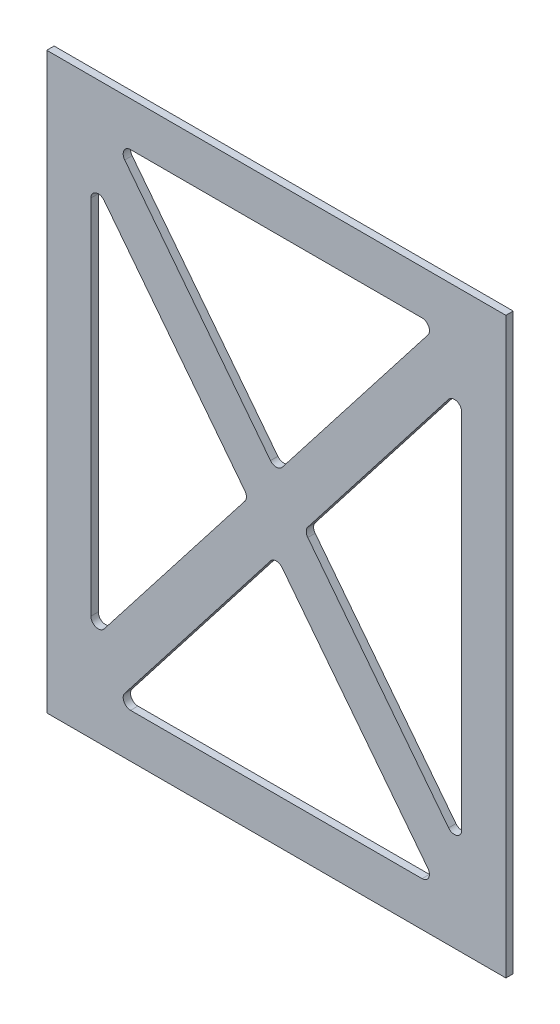
ISO-10303-21;
HEADER;
FILE_DESCRIPTION(('STEP AP214'),'2;1');
FILE_NAME('part.step','',(''),(''),'','','');
FILE_SCHEMA(('AUTOMOTIVE_DESIGN { 1 0 10303 214 1 1 1 1 }'));
ENDSEC;
DATA;
#1=APPLICATION_CONTEXT('core data for automotive mechanical design processes');
#2=APPLICATION_PROTOCOL_DEFINITION('international standard','automotive_design',2000,#1);
#3=PRODUCT_CONTEXT('',#1,'mechanical');
#4=PRODUCT('Part','Part','',(#3));
#5=PRODUCT_RELATED_PRODUCT_CATEGORY('part','',(#4));
#6=PRODUCT_DEFINITION_FORMATION('','',#4);
#7=PRODUCT_DEFINITION_CONTEXT('part definition',#1,'design');
#8=PRODUCT_DEFINITION('design','',#6,#7);
#9=PRODUCT_DEFINITION_SHAPE('','',#8);
#10=(LENGTH_UNIT() NAMED_UNIT(*) SI_UNIT(.MILLI.,.METRE.));
#11=(NAMED_UNIT(*) PLANE_ANGLE_UNIT() SI_UNIT($,.RADIAN.));
#12=(NAMED_UNIT(*) SI_UNIT($,.STERADIAN.) SOLID_ANGLE_UNIT());
#13=UNCERTAINTY_MEASURE_WITH_UNIT(LENGTH_MEASURE(1.E-05),#10,'distance_accuracy_value','');
#14=(GEOMETRIC_REPRESENTATION_CONTEXT(3) GLOBAL_UNCERTAINTY_ASSIGNED_CONTEXT((#13)) GLOBAL_UNIT_ASSIGNED_CONTEXT((#10,
#11,#12)) REPRESENTATION_CONTEXT('',''));
#15=CARTESIAN_POINT('',(0.,0.,0.));
#16=DIRECTION('',(0.,0.,1.));
#17=DIRECTION('',(1.,0.,0.));
#18=AXIS2_PLACEMENT_3D('',#15,#16,#17);
#19=CARTESIAN_POINT('',(0.,0.,3.175));
#20=DIRECTION('',(0.,0.,-1.));
#21=DIRECTION('',(-1.,0.,0.));
#22=AXIS2_PLACEMENT_3D('',#19,#20,#21);
#23=PLANE('',#22);
#24=DIRECTION('',(1.,0.,0.));
#25=VECTOR('',#24,1.);
#26=CARTESIAN_POINT('',(0.,-104.775,3.175));
#27=LINE('',#26,#25);
#28=CARTESIAN_POINT('',(-62.9032950021711,-104.775,3.175));
#29=VERTEX_POINT('',#28);
#30=CARTESIAN_POINT('',(62.9032950021708,-104.775,3.175));
#31=VERTEX_POINT('',#30);
#32=EDGE_CURVE('E630',#29,#31,#27,.T.);
#33=ORIENTED_EDGE('',*,*,#32,.F.);
#34=CARTESIAN_POINT('',(-62.9032950021711,-101.6,3.175));
#35=DIRECTION('',(0.,0.,-1.));
#36=DIRECTION('',(-1.,0.,0.));
#37=AXIS2_PLACEMENT_3D('',#34,#35,#36);
#38=CIRCLE('',#37,3.175);
#39=CARTESIAN_POINT('',(-65.4098739495395,-99.6512344983017,3.175));
#40=VERTEX_POINT('',#39);
#41=EDGE_CURVE('E433',#29,#40,#38,.T.);
#42=ORIENTED_EDGE('',*,*,#41,.T.);
#43=DIRECTION('',(0.613784409983716,0.789473684210526,0.));
#44=VECTOR('',#43,1.);
#45=CARTESIAN_POINT('',(7.51973684210525,-5.84629650509489,3.175));
#46=LINE('',#45,#44);
#47=CARTESIAN_POINT('',(-2.50657894736846,-18.7425387957454,3.175));
#48=VERTEX_POINT('',#47);
#49=EDGE_CURVE('E636',#40,#48,#46,.T.);
#50=ORIENTED_EDGE('',*,*,#49,.T.);
#51=CARTESIAN_POINT('',(0.,-20.6913042974437,3.175));
#52=DIRECTION('',(0.,0.,-1.));
#53=DIRECTION('',(-1.,0.,0.));
#54=AXIS2_PLACEMENT_3D('',#51,#52,#53);
#55=CIRCLE('',#54,3.175);
#56=CARTESIAN_POINT('',(2.50657894736839,-18.7425387957454,3.175));
#57=VERTEX_POINT('',#56);
#58=EDGE_CURVE('E427',#48,#57,#55,.T.);
#59=ORIENTED_EDGE('',*,*,#58,.T.);
#60=DIRECTION('',(0.613784409983716,-0.789473684210527,0.));
#61=VECTOR('',#60,1.);
#62=CARTESIAN_POINT('',(-7.51973684210529,-5.84629650509491,3.175));
#63=LINE('',#62,#61);
#64=CARTESIAN_POINT('',(65.4098739495393,-99.6512344983017,3.175));
#65=VERTEX_POINT('',#64);
#66=EDGE_CURVE('E631',#57,#65,#63,.T.);
#67=ORIENTED_EDGE('',*,*,#66,.T.);
#68=CARTESIAN_POINT('',(62.9032950021708,-101.6,3.175));
#69=DIRECTION('',(0.,0.,-1.));
#70=DIRECTION('',(-1.,0.,0.));
#71=AXIS2_PLACEMENT_3D('',#68,#69,#70);
#72=CIRCLE('',#71,3.175);
#73=EDGE_CURVE('E415',#65,#31,#72,.T.);
#74=ORIENTED_EDGE('',*,*,#73,.T.);
#75=EDGE_LOOP('',(#33,#42,#50,#59,#67,#74));
#76=FACE_BOUND('',#75,.T.);
#77=DIRECTION('',(0.,1.,0.));
#78=VECTOR('',#77,1.);
#79=CARTESIAN_POINT('',(99.06,-123.825,3.175));
#80=LINE('',#79,#78);
#81=CARTESIAN_POINT('',(99.06,-123.825,3.175));
#82=VERTEX_POINT('',#81);
#83=CARTESIAN_POINT('',(99.06,123.825,3.175));
#84=VERTEX_POINT('',#83);
#85=EDGE_CURVE('E310',#82,#84,#80,.T.);
#86=ORIENTED_EDGE('',*,*,#85,.T.);
#87=DIRECTION('',(-1.,0.,0.));
#88=VECTOR('',#87,1.);
#89=CARTESIAN_POINT('',(-99.06,123.825,3.175));
#90=LINE('',#89,#88);
#91=CARTESIAN_POINT('',(-99.06,123.825,3.175));
#92=VERTEX_POINT('',#91);
#93=EDGE_CURVE('E298',#84,#92,#90,.T.);
#94=ORIENTED_EDGE('',*,*,#93,.T.);
#95=DIRECTION('',(0.,-1.,0.));
#96=VECTOR('',#95,1.);
#97=CARTESIAN_POINT('',(-99.06,-123.825,3.175));
#98=LINE('',#97,#96);
#99=CARTESIAN_POINT('',(-99.06,-123.825,3.175));
#100=VERTEX_POINT('',#99);
#101=EDGE_CURVE('E309',#92,#100,#98,.T.);
#102=ORIENTED_EDGE('',*,*,#101,.T.);
#103=DIRECTION('',(1.,0.,0.));
#104=VECTOR('',#103,1.);
#105=CARTESIAN_POINT('',(-99.06,-123.825,3.175));
#106=LINE('',#105,#104);
#107=EDGE_CURVE('E315',#100,#82,#106,.T.);
#108=ORIENTED_EDGE('',*,*,#107,.T.);
#109=EDGE_LOOP('',(#86,#94,#102,#108));
#110=FACE_BOUND('',#109,.T.);
#111=DIRECTION('',(0.613784409983716,0.789473684210526,0.));
#112=VECTOR('',#111,1.);
#113=CARTESIAN_POINT('',(-7.51973684210525,5.84629650509489,3.175));
#114=LINE('',#113,#112);
#115=CARTESIAN_POINT('',(-74.3284210526315,-80.0856646249395,3.175));
#116=VERTEX_POINT('',#115);
#117=CARTESIAN_POINT('',(-13.5800877192983,-1.94876550169832,3.175));
#118=VERTEX_POINT('',#117);
#119=EDGE_CURVE('E498',#116,#118,#114,.T.);
#120=ORIENTED_EDGE('',*,*,#119,.F.);
#121=CARTESIAN_POINT('',(-76.835,-78.1368991232412,3.175));
#122=DIRECTION('',(0.,0.,-1.));
#123=DIRECTION('',(-1.,0.,0.));
#124=AXIS2_PLACEMENT_3D('',#121,#122,#123);
#125=CIRCLE('',#124,3.175);
#126=CARTESIAN_POINT('',(-80.0099999999999,-78.1368991232412,3.175));
#127=VERTEX_POINT('',#126);
#128=EDGE_CURVE('E439',#116,#127,#125,.T.);
#129=ORIENTED_EDGE('',*,*,#128,.T.);
#130=DIRECTION('',(0.,1.,0.));
#131=VECTOR('',#130,1.);
#132=CARTESIAN_POINT('',(-80.0099999999999,0.,3.175));
#133=LINE('',#132,#131);
#134=CARTESIAN_POINT('',(-80.0099999999999,78.1368991232413,3.175));
#135=VERTEX_POINT('',#134);
#136=EDGE_CURVE('E487',#127,#135,#133,.T.);
#137=ORIENTED_EDGE('',*,*,#136,.T.);
#138=CARTESIAN_POINT('',(-76.835,78.1368991232413,3.175));
#139=DIRECTION('',(0.,0.,-1.));
#140=DIRECTION('',(-1.,0.,0.));
#141=AXIS2_PLACEMENT_3D('',#138,#139,#140);
#142=CIRCLE('',#141,3.175);
#143=CARTESIAN_POINT('',(-74.3284210526316,80.0856646249396,3.175));
#144=VERTEX_POINT('',#143);
#145=EDGE_CURVE('E120',#135,#144,#142,.T.);
#146=ORIENTED_EDGE('',*,*,#145,.T.);
#147=DIRECTION('',(0.613784409983716,-0.789473684210527,0.));
#148=VECTOR('',#147,1.);
#149=CARTESIAN_POINT('',(-7.51973684210529,-5.84629650509491,3.175));
#150=LINE('',#149,#148);
#151=CARTESIAN_POINT('',(-13.5800877192983,1.94876550169828,3.175));
#152=VERTEX_POINT('',#151);
#153=EDGE_CURVE('E485',#144,#152,#150,.T.);
#154=ORIENTED_EDGE('',*,*,#153,.T.);
#155=CARTESIAN_POINT('',(-16.0866666666667,0.,3.175));
#156=DIRECTION('',(0.,0.,-1.));
#157=DIRECTION('',(-1.,0.,0.));
#158=AXIS2_PLACEMENT_3D('',#155,#156,#157);
#159=CIRCLE('',#158,3.175);
#160=EDGE_CURVE('E463',#152,#118,#159,.T.);
#161=ORIENTED_EDGE('',*,*,#160,.T.);
#162=EDGE_LOOP('',(#120,#129,#137,#146,#154,#161));
#163=FACE_BOUND('',#162,.T.);
#164=DIRECTION('',(0.613784409983716,0.789473684210526,0.));
#165=VECTOR('',#164,1.);
#166=CARTESIAN_POINT('',(-7.51973684210525,5.84629650509489,3.175));
#167=LINE('',#166,#165);
#168=CARTESIAN_POINT('',(2.50657894736844,18.7425387957454,3.175));
#169=VERTEX_POINT('',#168);
#170=CARTESIAN_POINT('',(65.4098739495395,99.6512344983017,3.175));
#171=VERTEX_POINT('',#170);
#172=EDGE_CURVE('E682',#169,#171,#167,.T.);
#173=ORIENTED_EDGE('',*,*,#172,.F.);
#174=CARTESIAN_POINT('',(0.,20.6913042974437,3.175));
#175=DIRECTION('',(0.,0.,-1.));
#176=DIRECTION('',(-1.,0.,0.));
#177=AXIS2_PLACEMENT_3D('',#174,#175,#176);
#178=CIRCLE('',#177,3.175);
#179=CARTESIAN_POINT('',(-2.50657894736841,18.7425387957454,3.175));
#180=VERTEX_POINT('',#179);
#181=EDGE_CURVE('E469',#169,#180,#178,.T.);
#182=ORIENTED_EDGE('',*,*,#181,.T.);
#183=DIRECTION('',(0.613784409983716,-0.789473684210527,0.));
#184=VECTOR('',#183,1.);
#185=CARTESIAN_POINT('',(7.51973684210528,5.8462965050949,3.175));
#186=LINE('',#185,#184);
#187=CARTESIAN_POINT('',(-65.4098739495394,99.6512344983017,3.175));
#188=VERTEX_POINT('',#187);
#189=EDGE_CURVE('E679',#188,#180,#186,.T.);
#190=ORIENTED_EDGE('',*,*,#189,.F.);
#191=CARTESIAN_POINT('',(-62.9032950021709,101.6,3.175));
#192=DIRECTION('',(0.,0.,-1.));
#193=DIRECTION('',(-1.,0.,0.));
#194=AXIS2_PLACEMENT_3D('',#191,#192,#193);
#195=CIRCLE('',#194,3.175);
#196=CARTESIAN_POINT('',(-62.9032950021709,104.775,3.175));
#197=VERTEX_POINT('',#196);
#198=EDGE_CURVE('E475',#188,#197,#195,.T.);
#199=ORIENTED_EDGE('',*,*,#198,.T.);
#200=DIRECTION('',(1.,0.,0.));
#201=VECTOR('',#200,1.);
#202=CARTESIAN_POINT('',(0.,104.775,3.175));
#203=LINE('',#202,#201);
#204=CARTESIAN_POINT('',(62.9032950021711,104.775,3.175));
#205=VERTEX_POINT('',#204);
#206=EDGE_CURVE('E686',#197,#205,#203,.T.);
#207=ORIENTED_EDGE('',*,*,#206,.T.);
#208=CARTESIAN_POINT('',(62.9032950021711,101.6,3.175));
#209=DIRECTION('',(0.,0.,-1.));
#210=DIRECTION('',(-1.,0.,0.));
#211=AXIS2_PLACEMENT_3D('',#208,#209,#210);
#212=CIRCLE('',#211,3.175);
#213=EDGE_CURVE('E451',#205,#171,#212,.T.);
#214=ORIENTED_EDGE('',*,*,#213,.T.);
#215=EDGE_LOOP('',(#173,#182,#190,#199,#207,#214));
#216=FACE_BOUND('',#215,.T.);
#217=DIRECTION('',(0.613784409983716,-0.789473684210527,0.));
#218=VECTOR('',#217,1.);
#219=CARTESIAN_POINT('',(7.51973684210528,5.8462965050949,3.175));
#220=LINE('',#219,#218);
#221=CARTESIAN_POINT('',(13.5800877192982,-1.94876550169829,3.175));
#222=VERTEX_POINT('',#221);
#223=CARTESIAN_POINT('',(74.3284210526316,-80.0856646249396,3.175));
#224=VERTEX_POINT('',#223);
#225=EDGE_CURVE('E660',#222,#224,#220,.T.);
#226=ORIENTED_EDGE('',*,*,#225,.F.);
#227=CARTESIAN_POINT('',(16.0866666666667,0.,3.175));
#228=DIRECTION('',(0.,0.,-1.));
#229=DIRECTION('',(-1.,0.,0.));
#230=AXIS2_PLACEMENT_3D('',#227,#228,#229);
#231=CIRCLE('',#230,3.175);
#232=CARTESIAN_POINT('',(13.5800877192982,1.94876550169831,3.175));
#233=VERTEX_POINT('',#232);
#234=EDGE_CURVE('E457',#222,#233,#231,.T.);
#235=ORIENTED_EDGE('',*,*,#234,.T.);
#236=DIRECTION('',(0.613784409983716,0.789473684210526,0.));
#237=VECTOR('',#236,1.);
#238=CARTESIAN_POINT('',(7.51973684210525,-5.84629650509489,3.175));
#239=LINE('',#238,#237);
#240=CARTESIAN_POINT('',(74.3284210526315,80.0856646249395,3.175));
#241=VERTEX_POINT('',#240);
#242=EDGE_CURVE('E656',#233,#241,#239,.T.);
#243=ORIENTED_EDGE('',*,*,#242,.T.);
#244=CARTESIAN_POINT('',(76.835,78.1368991232412,3.175));
#245=DIRECTION('',(0.,0.,-1.));
#246=DIRECTION('',(-1.,0.,0.));
#247=AXIS2_PLACEMENT_3D('',#244,#245,#246);
#248=CIRCLE('',#247,3.175);
#249=CARTESIAN_POINT('',(80.01,78.1368991232412,3.175));
#250=VERTEX_POINT('',#249);
#251=EDGE_CURVE('E445',#241,#250,#248,.T.);
#252=ORIENTED_EDGE('',*,*,#251,.T.);
#253=DIRECTION('',(0.,1.,0.));
#254=VECTOR('',#253,1.);
#255=CARTESIAN_POINT('',(80.01,0.,3.175));
#256=LINE('',#255,#254);
#257=CARTESIAN_POINT('',(80.01,-78.1368991232413,3.175));
#258=VERTEX_POINT('',#257);
#259=EDGE_CURVE('E664',#258,#250,#256,.T.);
#260=ORIENTED_EDGE('',*,*,#259,.F.);
#261=CARTESIAN_POINT('',(76.835,-78.1368991232413,3.175));
#262=DIRECTION('',(0.,0.,-1.));
#263=DIRECTION('',(-1.,0.,0.));
#264=AXIS2_PLACEMENT_3D('',#261,#262,#263);
#265=CIRCLE('',#264,3.175);
#266=EDGE_CURVE('E421',#258,#224,#265,.T.);
#267=ORIENTED_EDGE('',*,*,#266,.T.);
#268=EDGE_LOOP('',(#226,#235,#243,#252,#260,#267));
#269=FACE_BOUND('',#268,.T.);
#270=ADVANCED_FACE('F111',(#76,#110,#163,#216,#269),#23,.F.);
#271=CARTESIAN_POINT('',(0.,0.,0.));
#272=DIRECTION('',(0.,0.,-1.));
#273=DIRECTION('',(-1.,0.,0.));
#274=AXIS2_PLACEMENT_3D('',#271,#272,#273);
#275=PLANE('',#274);
#276=DIRECTION('',(1.,0.,0.));
#277=VECTOR('',#276,1.);
#278=CARTESIAN_POINT('',(0.,104.775,0.));
#279=LINE('',#278,#277);
#280=CARTESIAN_POINT('',(-62.9032950021709,104.775,0.));
#281=VERTEX_POINT('',#280);
#282=CARTESIAN_POINT('',(62.9032950021711,104.775,0.));
#283=VERTEX_POINT('',#282);
#284=EDGE_CURVE('E672',#281,#283,#279,.T.);
#285=ORIENTED_EDGE('',*,*,#284,.F.);
#286=CARTESIAN_POINT('',(-62.9032950021709,101.6,0.));
#287=DIRECTION('',(0.,0.,-1.));
#288=DIRECTION('',(-1.,0.,0.));
#289=AXIS2_PLACEMENT_3D('',#286,#287,#288);
#290=CIRCLE('',#289,3.175);
#291=CARTESIAN_POINT('',(-65.4098739495394,99.6512344983017,0.));
#292=VERTEX_POINT('',#291);
#293=EDGE_CURVE('E134',#281,#292,#290,.F.);
#294=ORIENTED_EDGE('',*,*,#293,.T.);
#295=DIRECTION('',(0.613784409983716,-0.789473684210527,0.));
#296=VECTOR('',#295,1.);
#297=CARTESIAN_POINT('',(7.51973684210528,5.8462965050949,0.));
#298=LINE('',#297,#296);
#299=CARTESIAN_POINT('',(-2.5065789473684,18.7425387957454,0.));
#300=VERTEX_POINT('',#299);
#301=EDGE_CURVE('E676',#292,#300,#298,.T.);
#302=ORIENTED_EDGE('',*,*,#301,.T.);
#303=CARTESIAN_POINT('',(0.,20.6913042974437,0.));
#304=DIRECTION('',(0.,0.,-1.));
#305=DIRECTION('',(-1.,0.,0.));
#306=AXIS2_PLACEMENT_3D('',#303,#304,#305);
#307=CIRCLE('',#306,3.175);
#308=CARTESIAN_POINT('',(2.50657894736844,18.7425387957454,0.));
#309=VERTEX_POINT('',#308);
#310=EDGE_CURVE('E472',#300,#309,#307,.F.);
#311=ORIENTED_EDGE('',*,*,#310,.T.);
#312=DIRECTION('',(0.613784409983716,0.789473684210526,0.));
#313=VECTOR('',#312,1.);
#314=CARTESIAN_POINT('',(-7.51973684210525,5.84629650509489,0.));
#315=LINE('',#314,#313);
#316=CARTESIAN_POINT('',(65.4098739495395,99.6512344983017,0.));
#317=VERTEX_POINT('',#316);
#318=EDGE_CURVE('E517',#309,#317,#315,.T.);
#319=ORIENTED_EDGE('',*,*,#318,.T.);
#320=CARTESIAN_POINT('',(62.9032950021711,101.6,0.));
#321=DIRECTION('',(0.,0.,-1.));
#322=DIRECTION('',(-1.,0.,0.));
#323=AXIS2_PLACEMENT_3D('',#320,#321,#322);
#324=CIRCLE('',#323,3.175);
#325=EDGE_CURVE('E454',#317,#283,#324,.F.);
#326=ORIENTED_EDGE('',*,*,#325,.T.);
#327=EDGE_LOOP('',(#285,#294,#302,#311,#319,#326));
#328=FACE_BOUND('',#327,.T.);
#329=DIRECTION('',(0.,1.,0.));
#330=VECTOR('',#329,1.);
#331=CARTESIAN_POINT('',(99.06,-123.825,0.));
#332=LINE('',#331,#330);
#333=CARTESIAN_POINT('',(99.06,-123.825,0.));
#334=VERTEX_POINT('',#333);
#335=CARTESIAN_POINT('',(99.06,123.825,0.));
#336=VERTEX_POINT('',#335);
#337=EDGE_CURVE('E324',#334,#336,#332,.T.);
#338=ORIENTED_EDGE('',*,*,#337,.F.);
#339=DIRECTION('',(1.,0.,0.));
#340=VECTOR('',#339,1.);
#341=CARTESIAN_POINT('',(-99.06,-123.825,0.));
#342=LINE('',#341,#340);
#343=CARTESIAN_POINT('',(-99.06,-123.825,0.));
#344=VERTEX_POINT('',#343);
#345=EDGE_CURVE('E320',#344,#334,#342,.T.);
#346=ORIENTED_EDGE('',*,*,#345,.F.);
#347=DIRECTION('',(0.,-1.,0.));
#348=VECTOR('',#347,1.);
#349=CARTESIAN_POINT('',(-99.06,-123.825,0.));
#350=LINE('',#349,#348);
#351=CARTESIAN_POINT('',(-99.06,123.825,0.));
#352=VERTEX_POINT('',#351);
#353=EDGE_CURVE('E537',#352,#344,#350,.T.);
#354=ORIENTED_EDGE('',*,*,#353,.F.);
#355=DIRECTION('',(-1.,0.,0.));
#356=VECTOR('',#355,1.);
#357=CARTESIAN_POINT('',(-99.06,123.825,0.));
#358=LINE('',#357,#356);
#359=EDGE_CURVE('E534',#336,#352,#358,.T.);
#360=ORIENTED_EDGE('',*,*,#359,.F.);
#361=EDGE_LOOP('',(#338,#346,#354,#360));
#362=FACE_BOUND('',#361,.T.);
#363=DIRECTION('',(0.613784409983715,-0.789473684210527,0.));
#364=VECTOR('',#363,1.);
#365=CARTESIAN_POINT('',(-7.51973684210529,-5.84629650509491,0.));
#366=LINE('',#365,#364);
#367=CARTESIAN_POINT('',(-74.3284210526315,80.0856646249396,0.));
#368=VERTEX_POINT('',#367);
#369=CARTESIAN_POINT('',(-13.5800877192983,1.94876550169828,0.));
#370=VERTEX_POINT('',#369);
#371=EDGE_CURVE('E508',#368,#370,#366,.T.);
#372=ORIENTED_EDGE('',*,*,#371,.F.);
#373=CARTESIAN_POINT('',(-76.835,78.1368991232413,0.));
#374=DIRECTION('',(0.,0.,-1.));
#375=DIRECTION('',(-1.,0.,0.));
#376=AXIS2_PLACEMENT_3D('',#373,#374,#375);
#377=CIRCLE('',#376,3.175);
#378=CARTESIAN_POINT('',(-80.0099999999999,78.1368991232413,0.));
#379=VERTEX_POINT('',#378);
#380=EDGE_CURVE('E12',#368,#379,#377,.F.);
#381=ORIENTED_EDGE('',*,*,#380,.T.);
#382=DIRECTION('',(0.,1.,0.));
#383=VECTOR('',#382,1.);
#384=CARTESIAN_POINT('',(-80.0099999999999,0.,0.));
#385=LINE('',#384,#383);
#386=CARTESIAN_POINT('',(-80.0099999999999,-78.1368991232412,0.));
#387=VERTEX_POINT('',#386);
#388=EDGE_CURVE('E506',#387,#379,#385,.T.);
#389=ORIENTED_EDGE('',*,*,#388,.F.);
#390=CARTESIAN_POINT('',(-76.835,-78.1368991232412,0.));
#391=DIRECTION('',(0.,0.,-1.));
#392=DIRECTION('',(-1.,0.,0.));
#393=AXIS2_PLACEMENT_3D('',#390,#391,#392);
#394=CIRCLE('',#393,3.175);
#395=CARTESIAN_POINT('',(-74.3284210526315,-80.0856646249395,0.));
#396=VERTEX_POINT('',#395);
#397=EDGE_CURVE('E442',#387,#396,#394,.F.);
#398=ORIENTED_EDGE('',*,*,#397,.T.);
#399=DIRECTION('',(0.613784409983716,0.789473684210526,0.));
#400=VECTOR('',#399,1.);
#401=CARTESIAN_POINT('',(-7.51973684210525,5.84629650509489,0.));
#402=LINE('',#401,#400);
#403=CARTESIAN_POINT('',(-13.5800877192983,-1.94876550169832,0.));
#404=VERTEX_POINT('',#403);
#405=EDGE_CURVE('E497',#396,#404,#402,.T.);
#406=ORIENTED_EDGE('',*,*,#405,.T.);
#407=CARTESIAN_POINT('',(-16.0866666666667,0.,0.));
#408=DIRECTION('',(0.,0.,-1.));
#409=DIRECTION('',(-1.,0.,0.));
#410=AXIS2_PLACEMENT_3D('',#407,#408,#409);
#411=CIRCLE('',#410,3.175);
#412=EDGE_CURVE('E466',#404,#370,#411,.F.);
#413=ORIENTED_EDGE('',*,*,#412,.T.);
#414=EDGE_LOOP('',(#372,#381,#389,#398,#406,#413));
#415=FACE_BOUND('',#414,.T.);
#416=DIRECTION('',(0.613784409983715,-0.789473684210527,0.));
#417=VECTOR('',#416,1.);
#418=CARTESIAN_POINT('',(-7.51973684210529,-5.84629650509491,0.));
#419=LINE('',#418,#417);
#420=CARTESIAN_POINT('',(2.50657894736839,-18.7425387957454,0.));
#421=VERTEX_POINT('',#420);
#422=CARTESIAN_POINT('',(65.4098739495393,-99.6512344983017,0.));
#423=VERTEX_POINT('',#422);
#424=EDGE_CURVE('E617',#421,#423,#419,.T.);
#425=ORIENTED_EDGE('',*,*,#424,.F.);
#426=CARTESIAN_POINT('',(0.,-20.6913042974437,0.));
#427=DIRECTION('',(0.,0.,-1.));
#428=DIRECTION('',(-1.,0.,0.));
#429=AXIS2_PLACEMENT_3D('',#426,#427,#428);
#430=CIRCLE('',#429,3.175);
#431=CARTESIAN_POINT('',(-2.50657894736846,-18.7425387957454,0.));
#432=VERTEX_POINT('',#431);
#433=EDGE_CURVE('E430',#421,#432,#430,.F.);
#434=ORIENTED_EDGE('',*,*,#433,.T.);
#435=DIRECTION('',(0.613784409983716,0.789473684210526,0.));
#436=VECTOR('',#435,1.);
#437=CARTESIAN_POINT('',(7.51973684210525,-5.84629650509489,0.));
#438=LINE('',#437,#436);
#439=CARTESIAN_POINT('',(-65.4098739495395,-99.6512344983017,0.));
#440=VERTEX_POINT('',#439);
#441=EDGE_CURVE('E624',#440,#432,#438,.T.);
#442=ORIENTED_EDGE('',*,*,#441,.F.);
#443=CARTESIAN_POINT('',(-62.9032950021711,-101.6,0.));
#444=DIRECTION('',(0.,0.,-1.));
#445=DIRECTION('',(-1.,0.,0.));
#446=AXIS2_PLACEMENT_3D('',#443,#444,#445);
#447=CIRCLE('',#446,3.175);
#448=CARTESIAN_POINT('',(-62.9032950021711,-104.775,0.));
#449=VERTEX_POINT('',#448);
#450=EDGE_CURVE('E436',#440,#449,#447,.F.);
#451=ORIENTED_EDGE('',*,*,#450,.T.);
#452=DIRECTION('',(1.,0.,0.));
#453=VECTOR('',#452,1.);
#454=CARTESIAN_POINT('',(0.,-104.775,0.));
#455=LINE('',#454,#453);
#456=CARTESIAN_POINT('',(62.9032950021708,-104.775,0.));
#457=VERTEX_POINT('',#456);
#458=EDGE_CURVE('E640',#449,#457,#455,.T.);
#459=ORIENTED_EDGE('',*,*,#458,.T.);
#460=CARTESIAN_POINT('',(62.9032950021708,-101.6,0.));
#461=DIRECTION('',(0.,0.,-1.));
#462=DIRECTION('',(-1.,0.,0.));
#463=AXIS2_PLACEMENT_3D('',#460,#461,#462);
#464=CIRCLE('',#463,3.175);
#465=EDGE_CURVE('E418',#457,#423,#464,.F.);
#466=ORIENTED_EDGE('',*,*,#465,.T.);
#467=EDGE_LOOP('',(#425,#434,#442,#451,#459,#466));
#468=FACE_BOUND('',#467,.T.);
#469=DIRECTION('',(0.613784409983716,-0.789473684210527,0.));
#470=VECTOR('',#469,1.);
#471=CARTESIAN_POINT('',(7.51973684210528,5.8462965050949,0.));
#472=LINE('',#471,#470);
#473=CARTESIAN_POINT('',(13.5800877192982,-1.94876550169828,0.));
#474=VERTEX_POINT('',#473);
#475=CARTESIAN_POINT('',(74.3284210526316,-80.0856646249396,0.));
#476=VERTEX_POINT('',#475);
#477=EDGE_CURVE('E668',#474,#476,#472,.T.);
#478=ORIENTED_EDGE('',*,*,#477,.T.);
#479=CARTESIAN_POINT('',(76.835,-78.1368991232413,0.));
#480=DIRECTION('',(0.,0.,-1.));
#481=DIRECTION('',(-1.,0.,0.));
#482=AXIS2_PLACEMENT_3D('',#479,#480,#481);
#483=CIRCLE('',#482,3.175);
#484=CARTESIAN_POINT('',(80.01,-78.1368991232413,0.));
#485=VERTEX_POINT('',#484);
#486=EDGE_CURVE('E424',#476,#485,#483,.F.);
#487=ORIENTED_EDGE('',*,*,#486,.T.);
#488=DIRECTION('',(0.,1.,0.));
#489=VECTOR('',#488,1.);
#490=CARTESIAN_POINT('',(80.01,0.,0.));
#491=LINE('',#490,#489);
#492=CARTESIAN_POINT('',(80.01,78.1368991232412,0.));
#493=VERTEX_POINT('',#492);
#494=EDGE_CURVE('E648',#485,#493,#491,.T.);
#495=ORIENTED_EDGE('',*,*,#494,.T.);
#496=CARTESIAN_POINT('',(76.835,78.1368991232412,0.));
#497=DIRECTION('',(0.,0.,-1.));
#498=DIRECTION('',(-1.,0.,0.));
#499=AXIS2_PLACEMENT_3D('',#496,#497,#498);
#500=CIRCLE('',#499,3.175);
#501=CARTESIAN_POINT('',(74.3284210526315,80.0856646249395,0.));
#502=VERTEX_POINT('',#501);
#503=EDGE_CURVE('E448',#493,#502,#500,.F.);
#504=ORIENTED_EDGE('',*,*,#503,.T.);
#505=DIRECTION('',(0.613784409983716,0.789473684210526,0.));
#506=VECTOR('',#505,1.);
#507=CARTESIAN_POINT('',(7.51973684210525,-5.84629650509489,0.));
#508=LINE('',#507,#506);
#509=CARTESIAN_POINT('',(13.5800877192982,1.94876550169831,0.));
#510=VERTEX_POINT('',#509);
#511=EDGE_CURVE('E652',#510,#502,#508,.T.);
#512=ORIENTED_EDGE('',*,*,#511,.F.);
#513=CARTESIAN_POINT('',(16.0866666666667,0.,0.));
#514=DIRECTION('',(0.,0.,-1.));
#515=DIRECTION('',(-1.,0.,0.));
#516=AXIS2_PLACEMENT_3D('',#513,#514,#515);
#517=CIRCLE('',#516,3.175);
#518=EDGE_CURVE('E460',#510,#474,#517,.F.);
#519=ORIENTED_EDGE('',*,*,#518,.T.);
#520=EDGE_LOOP('',(#478,#487,#495,#504,#512,#519));
#521=FACE_BOUND('',#520,.T.);
#522=ADVANCED_FACE('F504',(#328,#362,#415,#468,#521),#275,.T.);
#523=CARTESIAN_POINT('',(99.06,-123.825,3.175));
#524=DIRECTION('',(-1.,0.,0.));
#525=DIRECTION('',(0.,0.,1.));
#526=AXIS2_PLACEMENT_3D('',#523,#524,#525);
#527=PLANE('',#526);
#528=ORIENTED_EDGE('',*,*,#337,.T.);
#529=DIRECTION('',(0.,0.,-1.));
#530=VECTOR('',#529,1.);
#531=CARTESIAN_POINT('',(99.06,123.825,3.175));
#532=LINE('',#531,#530);
#533=EDGE_CURVE('E302',#84,#336,#532,.T.);
#534=ORIENTED_EDGE('',*,*,#533,.F.);
#535=ORIENTED_EDGE('',*,*,#85,.F.);
#536=DIRECTION('',(0.,0.,-1.));
#537=VECTOR('',#536,1.);
#538=CARTESIAN_POINT('',(99.06,-123.825,3.175));
#539=LINE('',#538,#537);
#540=EDGE_CURVE('E531',#82,#334,#539,.T.);
#541=ORIENTED_EDGE('',*,*,#540,.T.);
#542=EDGE_LOOP('',(#528,#534,#535,#541));
#543=FACE_BOUND('',#542,.T.);
#544=ADVANCED_FACE('F322',(#543),#527,.F.);
#545=CARTESIAN_POINT('',(-99.06,123.825,3.175));
#546=DIRECTION('',(0.,-1.,0.));
#547=DIRECTION('',(0.,0.,-1.));
#548=AXIS2_PLACEMENT_3D('',#545,#546,#547);
#549=PLANE('',#548);
#550=ORIENTED_EDGE('',*,*,#359,.T.);
#551=DIRECTION('',(0.,0.,-1.));
#552=VECTOR('',#551,1.);
#553=CARTESIAN_POINT('',(-99.06,123.825,3.175));
#554=LINE('',#553,#552);
#555=EDGE_CURVE('E305',#92,#352,#554,.T.);
#556=ORIENTED_EDGE('',*,*,#555,.F.);
#557=ORIENTED_EDGE('',*,*,#93,.F.);
#558=ORIENTED_EDGE('',*,*,#533,.T.);
#559=EDGE_LOOP('',(#550,#556,#557,#558));
#560=FACE_BOUND('',#559,.T.);
#561=ADVANCED_FACE('F300',(#560),#549,.F.);
#562=CARTESIAN_POINT('',(-99.06,-123.825,3.175));
#563=DIRECTION('',(1.,0.,0.));
#564=DIRECTION('',(0.,0.,-1.));
#565=AXIS2_PLACEMENT_3D('',#562,#563,#564);
#566=PLANE('',#565);
#567=ORIENTED_EDGE('',*,*,#353,.T.);
#568=DIRECTION('',(0.,0.,-1.));
#569=VECTOR('',#568,1.);
#570=CARTESIAN_POINT('',(-99.06,-123.825,3.175));
#571=LINE('',#570,#569);
#572=EDGE_CURVE('E332',#100,#344,#571,.T.);
#573=ORIENTED_EDGE('',*,*,#572,.F.);
#574=ORIENTED_EDGE('',*,*,#101,.F.);
#575=ORIENTED_EDGE('',*,*,#555,.T.);
#576=EDGE_LOOP('',(#567,#573,#574,#575));
#577=FACE_BOUND('',#576,.T.);
#578=ADVANCED_FACE('F552',(#577),#566,.F.);
#579=CARTESIAN_POINT('',(-99.06,-123.825,3.175));
#580=DIRECTION('',(0.,1.,0.));
#581=DIRECTION('',(0.,0.,1.));
#582=AXIS2_PLACEMENT_3D('',#579,#580,#581);
#583=PLANE('',#582);
#584=ORIENTED_EDGE('',*,*,#345,.T.);
#585=ORIENTED_EDGE('',*,*,#540,.F.);
#586=ORIENTED_EDGE('',*,*,#107,.F.);
#587=ORIENTED_EDGE('',*,*,#572,.T.);
#588=EDGE_LOOP('',(#584,#585,#586,#587));
#589=FACE_BOUND('',#588,.T.);
#590=ADVANCED_FACE('F548',(#589),#583,.F.);
#591=CARTESIAN_POINT('',(-80.0099999999999,0.,-0.00100000000000013));
#592=DIRECTION('',(1.,0.,0.));
#593=DIRECTION('',(0.,0.,-1.));
#594=AXIS2_PLACEMENT_3D('',#591,#592,#593);
#595=PLANE('',#594);
#596=ORIENTED_EDGE('',*,*,#136,.F.);
#597=DIRECTION('',(0.,0.,1.));
#598=VECTOR('',#597,1.);
#599=CARTESIAN_POINT('',(-80.0099999999999,-78.1368991232412,-0.00100000000000013));
#600=LINE('',#599,#598);
#601=EDGE_CURVE('E378',#127,#387,#600,.F.);
#602=ORIENTED_EDGE('',*,*,#601,.T.);
#603=ORIENTED_EDGE('',*,*,#388,.T.);
#604=DIRECTION('',(0.,0.,1.));
#605=VECTOR('',#604,1.);
#606=CARTESIAN_POINT('',(-80.0099999999999,78.1368991232413,3.175));
#607=LINE('',#606,#605);
#608=EDGE_CURVE('E374',#379,#135,#607,.T.);
#609=ORIENTED_EDGE('',*,*,#608,.T.);
#610=EDGE_LOOP('',(#596,#602,#603,#609));
#611=FACE_BOUND('',#610,.T.);
#612=ADVANCED_FACE('F510',(#611),#595,.T.);
#613=CARTESIAN_POINT('',(-7.51973684210529,-5.84629650509491,-0.00100000000000013));
#614=DIRECTION('',(-0.789473684210527,-0.613784409983715,0.));
#615=DIRECTION('',(0.613784409983715,-0.789473684210527,0.));
#616=AXIS2_PLACEMENT_3D('',#613,#614,#615);
#617=PLANE('',#616);
#618=ORIENTED_EDGE('',*,*,#371,.T.);
#619=DIRECTION('',(0.,0.,1.));
#620=VECTOR('',#619,1.);
#621=CARTESIAN_POINT('',(-13.5800877192983,1.94876550169827,-0.00100000000000013));
#622=LINE('',#621,#620);
#623=EDGE_CURVE('E405',#370,#152,#622,.T.);
#624=ORIENTED_EDGE('',*,*,#623,.T.);
#625=ORIENTED_EDGE('',*,*,#153,.F.);
#626=DIRECTION('',(0.,0.,1.));
#627=VECTOR('',#626,1.);
#628=CARTESIAN_POINT('',(-74.3284210526315,80.0856646249396,0.));
#629=LINE('',#628,#627);
#630=EDGE_CURVE('E402',#144,#368,#629,.F.);
#631=ORIENTED_EDGE('',*,*,#630,.T.);
#632=EDGE_LOOP('',(#618,#624,#625,#631));
#633=FACE_BOUND('',#632,.T.);
#634=ADVANCED_FACE('F493',(#633),#617,.T.);
#635=CARTESIAN_POINT('',(-7.51973684210525,5.84629650509489,-0.00100000000000013));
#636=DIRECTION('',(0.789473684210526,-0.613784409983716,0.));
#637=DIRECTION('',(0.613784409983716,0.789473684210526,0.));
#638=AXIS2_PLACEMENT_3D('',#635,#636,#637);
#639=PLANE('',#638);
#640=ORIENTED_EDGE('',*,*,#405,.F.);
#641=DIRECTION('',(0.,0.,1.));
#642=VECTOR('',#641,1.);
#643=CARTESIAN_POINT('',(-74.3284210526315,-80.0856646249394,-0.00100000000000013));
#644=LINE('',#643,#642);
#645=EDGE_CURVE('E370',#396,#116,#644,.T.);
#646=ORIENTED_EDGE('',*,*,#645,.T.);
#647=ORIENTED_EDGE('',*,*,#119,.T.);
#648=DIRECTION('',(0.,0.,1.));
#649=VECTOR('',#648,1.);
#650=CARTESIAN_POINT('',(-13.5800877192983,-1.94876550169832,-0.00100000000000013));
#651=LINE('',#650,#649);
#652=EDGE_CURVE('E367',#118,#404,#651,.F.);
#653=ORIENTED_EDGE('',*,*,#652,.T.);
#654=EDGE_LOOP('',(#640,#646,#647,#653));
#655=FACE_BOUND('',#654,.T.);
#656=ADVANCED_FACE('F572',(#655),#639,.F.);
#657=CARTESIAN_POINT('',(7.51973684210525,-5.84629650509489,-0.00100000000000013));
#658=DIRECTION('',(0.789473684210526,-0.613784409983716,0.));
#659=DIRECTION('',(0.613784409983716,0.789473684210526,0.));
#660=AXIS2_PLACEMENT_3D('',#657,#658,#659);
#661=PLANE('',#660);
#662=ORIENTED_EDGE('',*,*,#441,.T.);
#663=DIRECTION('',(0.,0.,1.));
#664=VECTOR('',#663,1.);
#665=CARTESIAN_POINT('',(-2.50657894736846,-18.7425387957454,3.175));
#666=LINE('',#665,#664);
#667=EDGE_CURVE('E363',#432,#48,#666,.T.);
#668=ORIENTED_EDGE('',*,*,#667,.T.);
#669=ORIENTED_EDGE('',*,*,#49,.F.);
#670=DIRECTION('',(0.,0.,1.));
#671=VECTOR('',#670,1.);
#672=CARTESIAN_POINT('',(-65.4098739495395,-99.6512344983017,-0.00100000000000013));
#673=LINE('',#672,#671);
#674=EDGE_CURVE('E360',#40,#440,#673,.F.);
#675=ORIENTED_EDGE('',*,*,#674,.T.);
#676=EDGE_LOOP('',(#662,#668,#669,#675));
#677=FACE_BOUND('',#676,.T.);
#678=ADVANCED_FACE('F575',(#677),#661,.T.);
#679=CARTESIAN_POINT('',(-7.51973684210529,-5.84629650509491,-0.00100000000000013));
#680=DIRECTION('',(-0.789473684210527,-0.613784409983715,0.));
#681=DIRECTION('',(0.613784409983715,-0.789473684210527,0.));
#682=AXIS2_PLACEMENT_3D('',#679,#680,#681);
#683=PLANE('',#682);
#684=ORIENTED_EDGE('',*,*,#424,.T.);
#685=DIRECTION('',(0.,0.,1.));
#686=VECTOR('',#685,1.);
#687=CARTESIAN_POINT('',(65.4098739495393,-99.6512344983017,-0.00100000000000013));
#688=LINE('',#687,#686);
#689=EDGE_CURVE('E330',#423,#65,#688,.T.);
#690=ORIENTED_EDGE('',*,*,#689,.T.);
#691=ORIENTED_EDGE('',*,*,#66,.F.);
#692=DIRECTION('',(0.,0.,1.));
#693=VECTOR('',#692,1.);
#694=CARTESIAN_POINT('',(2.50657894736838,-18.7425387957454,0.));
#695=LINE('',#694,#693);
#696=EDGE_CURVE('E326',#57,#421,#695,.F.);
#697=ORIENTED_EDGE('',*,*,#696,.T.);
#698=EDGE_LOOP('',(#684,#690,#691,#697));
#699=FACE_BOUND('',#698,.T.);
#700=ADVANCED_FACE('F606',(#699),#683,.T.);
#701=CARTESIAN_POINT('',(0.,-104.775,-0.00100000000000013));
#702=DIRECTION('',(0.,-1.,0.));
#703=DIRECTION('',(0.,0.,-1.));
#704=AXIS2_PLACEMENT_3D('',#701,#702,#703);
#705=PLANE('',#704);
#706=ORIENTED_EDGE('',*,*,#32,.T.);
#707=DIRECTION('',(0.,0.,1.));
#708=VECTOR('',#707,1.);
#709=CARTESIAN_POINT('',(62.9032950021708,-104.775,-0.00100000000000013));
#710=LINE('',#709,#708);
#711=EDGE_CURVE('E343',#31,#457,#710,.F.);
#712=ORIENTED_EDGE('',*,*,#711,.T.);
#713=ORIENTED_EDGE('',*,*,#458,.F.);
#714=DIRECTION('',(0.,0.,1.));
#715=VECTOR('',#714,1.);
#716=CARTESIAN_POINT('',(-62.9032950021711,-104.775,-0.00100000000000013));
#717=LINE('',#716,#715);
#718=EDGE_CURVE('E339',#449,#29,#717,.T.);
#719=ORIENTED_EDGE('',*,*,#718,.T.);
#720=EDGE_LOOP('',(#706,#712,#713,#719));
#721=FACE_BOUND('',#720,.T.);
#722=ADVANCED_FACE('F583',(#721),#705,.F.);
#723=CARTESIAN_POINT('',(7.51973684210528,5.8462965050949,-0.00100000000000013));
#724=DIRECTION('',(-0.789473684210526,-0.613784409983716,0.));
#725=DIRECTION('',(0.613784409983716,-0.789473684210527,0.));
#726=AXIS2_PLACEMENT_3D('',#723,#724,#725);
#727=PLANE('',#726);
#728=ORIENTED_EDGE('',*,*,#189,.T.);
#729=DIRECTION('',(0.,0.,1.));
#730=VECTOR('',#729,1.);
#731=CARTESIAN_POINT('',(-2.5065789473684,18.7425387957454,0.));
#732=LINE('',#731,#730);
#733=EDGE_CURVE('E127',#180,#300,#732,.F.);
#734=ORIENTED_EDGE('',*,*,#733,.T.);
#735=ORIENTED_EDGE('',*,*,#301,.F.);
#736=DIRECTION('',(0.,0.,1.));
#737=VECTOR('',#736,1.);
#738=CARTESIAN_POINT('',(-65.4098739495393,99.6512344983017,-0.00100000000000013));
#739=LINE('',#738,#737);
#740=EDGE_CURVE('E409',#292,#188,#739,.T.);
#741=ORIENTED_EDGE('',*,*,#740,.T.);
#742=EDGE_LOOP('',(#728,#734,#735,#741));
#743=FACE_BOUND('',#742,.T.);
#744=ADVANCED_FACE('F579',(#743),#727,.F.);
#745=CARTESIAN_POINT('',(0.,104.775,-0.00100000000000013));
#746=DIRECTION('',(0.,-1.,0.));
#747=DIRECTION('',(0.,0.,-1.));
#748=AXIS2_PLACEMENT_3D('',#745,#746,#747);
#749=PLANE('',#748);
#750=ORIENTED_EDGE('',*,*,#284,.T.);
#751=DIRECTION('',(0.,0.,1.));
#752=VECTOR('',#751,1.);
#753=CARTESIAN_POINT('',(62.9032950021711,104.775,-0.00100000000000013));
#754=LINE('',#753,#752);
#755=EDGE_CURVE('E391',#283,#205,#754,.T.);
#756=ORIENTED_EDGE('',*,*,#755,.T.);
#757=ORIENTED_EDGE('',*,*,#206,.F.);
#758=DIRECTION('',(0.,0.,1.));
#759=VECTOR('',#758,1.);
#760=CARTESIAN_POINT('',(-62.9032950021709,104.775,-0.00100000000000013));
#761=LINE('',#760,#759);
#762=EDGE_CURVE('E388',#197,#281,#761,.F.);
#763=ORIENTED_EDGE('',*,*,#762,.T.);
#764=EDGE_LOOP('',(#750,#756,#757,#763));
#765=FACE_BOUND('',#764,.T.);
#766=ADVANCED_FACE('F582',(#765),#749,.T.);
#767=CARTESIAN_POINT('',(-7.51973684210525,5.84629650509489,-0.00100000000000013));
#768=DIRECTION('',(0.789473684210526,-0.613784409983716,0.));
#769=DIRECTION('',(0.613784409983716,0.789473684210526,0.));
#770=AXIS2_PLACEMENT_3D('',#767,#768,#769);
#771=PLANE('',#770);
#772=ORIENTED_EDGE('',*,*,#172,.T.);
#773=DIRECTION('',(0.,0.,1.));
#774=VECTOR('',#773,1.);
#775=CARTESIAN_POINT('',(65.4098739495395,99.6512344983017,-0.00100000000000013));
#776=LINE('',#775,#774);
#777=EDGE_CURVE('E399',#171,#317,#776,.F.);
#778=ORIENTED_EDGE('',*,*,#777,.T.);
#779=ORIENTED_EDGE('',*,*,#318,.F.);
#780=DIRECTION('',(0.,0.,1.));
#781=VECTOR('',#780,1.);
#782=CARTESIAN_POINT('',(2.50657894736844,18.7425387957454,3.175));
#783=LINE('',#782,#781);
#784=EDGE_CURVE('E395',#309,#169,#783,.T.);
#785=ORIENTED_EDGE('',*,*,#784,.T.);
#786=EDGE_LOOP('',(#772,#778,#779,#785));
#787=FACE_BOUND('',#786,.T.);
#788=ADVANCED_FACE('F584',(#787),#771,.F.);
#789=CARTESIAN_POINT('',(7.51973684210525,-5.84629650509489,-0.00100000000000013));
#790=DIRECTION('',(0.789473684210526,-0.613784409983716,0.));
#791=DIRECTION('',(0.613784409983716,0.789473684210526,0.));
#792=AXIS2_PLACEMENT_3D('',#789,#790,#791);
#793=PLANE('',#792);
#794=ORIENTED_EDGE('',*,*,#511,.T.);
#795=DIRECTION('',(0.,0.,1.));
#796=VECTOR('',#795,1.);
#797=CARTESIAN_POINT('',(74.3284210526315,80.0856646249395,-0.00100000000000013));
#798=LINE('',#797,#796);
#799=EDGE_CURVE('E384',#502,#241,#798,.T.);
#800=ORIENTED_EDGE('',*,*,#799,.T.);
#801=ORIENTED_EDGE('',*,*,#242,.F.);
#802=DIRECTION('',(0.,0.,1.));
#803=VECTOR('',#802,1.);
#804=CARTESIAN_POINT('',(13.5800877192982,1.94876550169831,-0.00100000000000013));
#805=LINE('',#804,#803);
#806=EDGE_CURVE('E381',#233,#510,#805,.F.);
#807=ORIENTED_EDGE('',*,*,#806,.T.);
#808=EDGE_LOOP('',(#794,#800,#801,#807));
#809=FACE_BOUND('',#808,.T.);
#810=ADVANCED_FACE('F587',(#809),#793,.T.);
#811=CARTESIAN_POINT('',(80.01,0.,-0.00100000000000013));
#812=DIRECTION('',(1.,0.,0.));
#813=DIRECTION('',(0.,0.,-1.));
#814=AXIS2_PLACEMENT_3D('',#811,#812,#813);
#815=PLANE('',#814);
#816=ORIENTED_EDGE('',*,*,#494,.F.);
#817=DIRECTION('',(0.,0.,1.));
#818=VECTOR('',#817,1.);
#819=CARTESIAN_POINT('',(80.01,-78.1368991232413,3.175));
#820=LINE('',#819,#818);
#821=EDGE_CURVE('E349',#485,#258,#820,.T.);
#822=ORIENTED_EDGE('',*,*,#821,.T.);
#823=ORIENTED_EDGE('',*,*,#259,.T.);
#824=DIRECTION('',(0.,0.,1.));
#825=VECTOR('',#824,1.);
#826=CARTESIAN_POINT('',(80.01,78.1368991232412,-0.00100000000000013));
#827=LINE('',#826,#825);
#828=EDGE_CURVE('E346',#250,#493,#827,.F.);
#829=ORIENTED_EDGE('',*,*,#828,.T.);
#830=EDGE_LOOP('',(#816,#822,#823,#829));
#831=FACE_BOUND('',#830,.T.);
#832=ADVANCED_FACE('F594',(#831),#815,.F.);
#833=CARTESIAN_POINT('',(7.51973684210528,5.8462965050949,-0.00100000000000013));
#834=DIRECTION('',(-0.789473684210526,-0.613784409983716,0.));
#835=DIRECTION('',(0.613784409983716,-0.789473684210527,0.));
#836=AXIS2_PLACEMENT_3D('',#833,#834,#835);
#837=PLANE('',#836);
#838=ORIENTED_EDGE('',*,*,#225,.T.);
#839=DIRECTION('',(0.,0.,1.));
#840=VECTOR('',#839,1.);
#841=CARTESIAN_POINT('',(74.3284210526315,-80.0856646249396,0.));
#842=LINE('',#841,#840);
#843=EDGE_CURVE('E357',#224,#476,#842,.F.);
#844=ORIENTED_EDGE('',*,*,#843,.T.);
#845=ORIENTED_EDGE('',*,*,#477,.F.);
#846=DIRECTION('',(0.,0.,1.));
#847=VECTOR('',#846,1.);
#848=CARTESIAN_POINT('',(13.5800877192982,-1.94876550169828,-0.00100000000000013));
#849=LINE('',#848,#847);
#850=EDGE_CURVE('E353',#474,#222,#849,.T.);
#851=ORIENTED_EDGE('',*,*,#850,.T.);
#852=EDGE_LOOP('',(#838,#844,#845,#851));
#853=FACE_BOUND('',#852,.T.);
#854=ADVANCED_FACE('F596',(#853),#837,.F.);
#855=CARTESIAN_POINT('',(62.9032950021708,-101.6,-0.00100000000000013));
#856=DIRECTION('',(0.,0.,1.));
#857=DIRECTION('',(1.,0.,0.));
#858=AXIS2_PLACEMENT_3D('',#855,#856,#857);
#859=CYLINDRICAL_SURFACE('',#858,3.175);
#860=ORIENTED_EDGE('',*,*,#465,.F.);
#861=ORIENTED_EDGE('',*,*,#711,.F.);
#862=ORIENTED_EDGE('',*,*,#73,.F.);
#863=ORIENTED_EDGE('',*,*,#689,.F.);
#864=EDGE_LOOP('',(#860,#861,#862,#863));
#865=FACE_BOUND('',#864,.T.);
#866=ADVANCED_FACE('F599',(#865),#859,.F.);
#867=CARTESIAN_POINT('',(76.835,-78.1368991232413,-0.00100000000000013));
#868=DIRECTION('',(0.,0.,-1.));
#869=DIRECTION('',(-1.,0.,0.));
#870=AXIS2_PLACEMENT_3D('',#867,#868,#869);
#871=CYLINDRICAL_SURFACE('',#870,3.175);
#872=ORIENTED_EDGE('',*,*,#486,.F.);
#873=ORIENTED_EDGE('',*,*,#843,.F.);
#874=ORIENTED_EDGE('',*,*,#266,.F.);
#875=ORIENTED_EDGE('',*,*,#821,.F.);
#876=EDGE_LOOP('',(#872,#873,#874,#875));
#877=FACE_BOUND('',#876,.T.);
#878=ADVANCED_FACE('F740',(#877),#871,.F.);
#879=CARTESIAN_POINT('',(0.,-20.6913042974437,-0.00100000000000013));
#880=DIRECTION('',(0.,0.,-1.));
#881=DIRECTION('',(-1.,0.,0.));
#882=AXIS2_PLACEMENT_3D('',#879,#880,#881);
#883=CYLINDRICAL_SURFACE('',#882,3.175);
#884=ORIENTED_EDGE('',*,*,#433,.F.);
#885=ORIENTED_EDGE('',*,*,#696,.F.);
#886=ORIENTED_EDGE('',*,*,#58,.F.);
#887=ORIENTED_EDGE('',*,*,#667,.F.);
#888=EDGE_LOOP('',(#884,#885,#886,#887));
#889=FACE_BOUND('',#888,.T.);
#890=ADVANCED_FACE('F736',(#889),#883,.F.);
#891=CARTESIAN_POINT('',(-62.9032950021711,-101.6,-0.00100000000000013));
#892=DIRECTION('',(0.,0.,1.));
#893=DIRECTION('',(1.,0.,0.));
#894=AXIS2_PLACEMENT_3D('',#891,#892,#893);
#895=CYLINDRICAL_SURFACE('',#894,3.175);
#896=ORIENTED_EDGE('',*,*,#450,.F.);
#897=ORIENTED_EDGE('',*,*,#674,.F.);
#898=ORIENTED_EDGE('',*,*,#41,.F.);
#899=ORIENTED_EDGE('',*,*,#718,.F.);
#900=EDGE_LOOP('',(#896,#897,#898,#899));
#901=FACE_BOUND('',#900,.T.);
#902=ADVANCED_FACE('F732',(#901),#895,.F.);
#903=CARTESIAN_POINT('',(-76.835,-78.1368991232412,-0.00100000000000013));
#904=DIRECTION('',(0.,0.,1.));
#905=DIRECTION('',(1.,0.,0.));
#906=AXIS2_PLACEMENT_3D('',#903,#904,#905);
#907=CYLINDRICAL_SURFACE('',#906,3.175);
#908=ORIENTED_EDGE('',*,*,#397,.F.);
#909=ORIENTED_EDGE('',*,*,#601,.F.);
#910=ORIENTED_EDGE('',*,*,#128,.F.);
#911=ORIENTED_EDGE('',*,*,#645,.F.);
#912=EDGE_LOOP('',(#908,#909,#910,#911));
#913=FACE_BOUND('',#912,.T.);
#914=ADVANCED_FACE('F728',(#913),#907,.F.);
#915=CARTESIAN_POINT('',(76.835,78.1368991232412,-0.00100000000000013));
#916=DIRECTION('',(0.,0.,1.));
#917=DIRECTION('',(1.,0.,0.));
#918=AXIS2_PLACEMENT_3D('',#915,#916,#917);
#919=CYLINDRICAL_SURFACE('',#918,3.175);
#920=ORIENTED_EDGE('',*,*,#503,.F.);
#921=ORIENTED_EDGE('',*,*,#828,.F.);
#922=ORIENTED_EDGE('',*,*,#251,.F.);
#923=ORIENTED_EDGE('',*,*,#799,.F.);
#924=EDGE_LOOP('',(#920,#921,#922,#923));
#925=FACE_BOUND('',#924,.T.);
#926=ADVANCED_FACE('F725',(#925),#919,.F.);
#927=CARTESIAN_POINT('',(62.9032950021711,101.6,-0.00100000000000013));
#928=DIRECTION('',(0.,0.,1.));
#929=DIRECTION('',(1.,0.,0.));
#930=AXIS2_PLACEMENT_3D('',#927,#928,#929);
#931=CYLINDRICAL_SURFACE('',#930,3.175);
#932=ORIENTED_EDGE('',*,*,#325,.F.);
#933=ORIENTED_EDGE('',*,*,#777,.F.);
#934=ORIENTED_EDGE('',*,*,#213,.F.);
#935=ORIENTED_EDGE('',*,*,#755,.F.);
#936=EDGE_LOOP('',(#932,#933,#934,#935));
#937=FACE_BOUND('',#936,.T.);
#938=ADVANCED_FACE('F698',(#937),#931,.F.);
#939=CARTESIAN_POINT('',(16.0866666666667,0.,-0.00100000000000013));
#940=DIRECTION('',(0.,0.,1.));
#941=DIRECTION('',(1.,0.,0.));
#942=AXIS2_PLACEMENT_3D('',#939,#940,#941);
#943=CYLINDRICAL_SURFACE('',#942,3.175);
#944=ORIENTED_EDGE('',*,*,#518,.F.);
#945=ORIENTED_EDGE('',*,*,#806,.F.);
#946=ORIENTED_EDGE('',*,*,#234,.F.);
#947=ORIENTED_EDGE('',*,*,#850,.F.);
#948=EDGE_LOOP('',(#944,#945,#946,#947));
#949=FACE_BOUND('',#948,.T.);
#950=ADVANCED_FACE('F716',(#949),#943,.F.);
#951=CARTESIAN_POINT('',(-16.0866666666667,0.,-0.00100000000000013));
#952=DIRECTION('',(0.,0.,1.));
#953=DIRECTION('',(1.,0.,0.));
#954=AXIS2_PLACEMENT_3D('',#951,#952,#953);
#955=CYLINDRICAL_SURFACE('',#954,3.175);
#956=ORIENTED_EDGE('',*,*,#412,.F.);
#957=ORIENTED_EDGE('',*,*,#652,.F.);
#958=ORIENTED_EDGE('',*,*,#160,.F.);
#959=ORIENTED_EDGE('',*,*,#623,.F.);
#960=EDGE_LOOP('',(#956,#957,#958,#959));
#961=FACE_BOUND('',#960,.T.);
#962=ADVANCED_FACE('F710',(#961),#955,.F.);
#963=CARTESIAN_POINT('',(0.,20.6913042974437,-0.00100000000000013));
#964=DIRECTION('',(0.,0.,-1.));
#965=DIRECTION('',(-1.,0.,0.));
#966=AXIS2_PLACEMENT_3D('',#963,#964,#965);
#967=CYLINDRICAL_SURFACE('',#966,3.175);
#968=ORIENTED_EDGE('',*,*,#310,.F.);
#969=ORIENTED_EDGE('',*,*,#733,.F.);
#970=ORIENTED_EDGE('',*,*,#181,.F.);
#971=ORIENTED_EDGE('',*,*,#784,.F.);
#972=EDGE_LOOP('',(#968,#969,#970,#971));
#973=FACE_BOUND('',#972,.T.);
#974=ADVANCED_FACE('F708',(#973),#967,.F.);
#975=CARTESIAN_POINT('',(-62.9032950021709,101.6,-0.00100000000000013));
#976=DIRECTION('',(0.,0.,1.));
#977=DIRECTION('',(1.,0.,0.));
#978=AXIS2_PLACEMENT_3D('',#975,#976,#977);
#979=CYLINDRICAL_SURFACE('',#978,3.175);
#980=ORIENTED_EDGE('',*,*,#293,.F.);
#981=ORIENTED_EDGE('',*,*,#762,.F.);
#982=ORIENTED_EDGE('',*,*,#198,.F.);
#983=ORIENTED_EDGE('',*,*,#740,.F.);
#984=EDGE_LOOP('',(#980,#981,#982,#983));
#985=FACE_BOUND('',#984,.T.);
#986=ADVANCED_FACE('F706',(#985),#979,.F.);
#987=CARTESIAN_POINT('',(-76.835,78.1368991232413,-0.00100000000000013));
#988=DIRECTION('',(0.,0.,-1.));
#989=DIRECTION('',(-1.,0.,0.));
#990=AXIS2_PLACEMENT_3D('',#987,#988,#989);
#991=CYLINDRICAL_SURFACE('',#990,3.175);
#992=ORIENTED_EDGE('',*,*,#380,.F.);
#993=ORIENTED_EDGE('',*,*,#630,.F.);
#994=ORIENTED_EDGE('',*,*,#145,.F.);
#995=ORIENTED_EDGE('',*,*,#608,.F.);
#996=EDGE_LOOP('',(#992,#993,#994,#995));
#997=FACE_BOUND('',#996,.T.);
#998=ADVANCED_FACE('F113',(#997),#991,.F.);
#999=CLOSED_SHELL('',(#270,#522,#544,#561,#578,#590,#612,#634,#656,#678,#700,#722,#744,#766,
#788,#810,#832,#854,#866,#878,#890,#902,#914,#926,#938,#950,#962,#974,#986,#998));
#1000=MANIFOLD_SOLID_BREP('B2',#999);
#1001=ADVANCED_BREP_SHAPE_REPRESENTATION('',(#18,#1000),#14);
#1002=SHAPE_DEFINITION_REPRESENTATION(#9,#1001);
ENDSEC;
END-ISO-10303-21;
